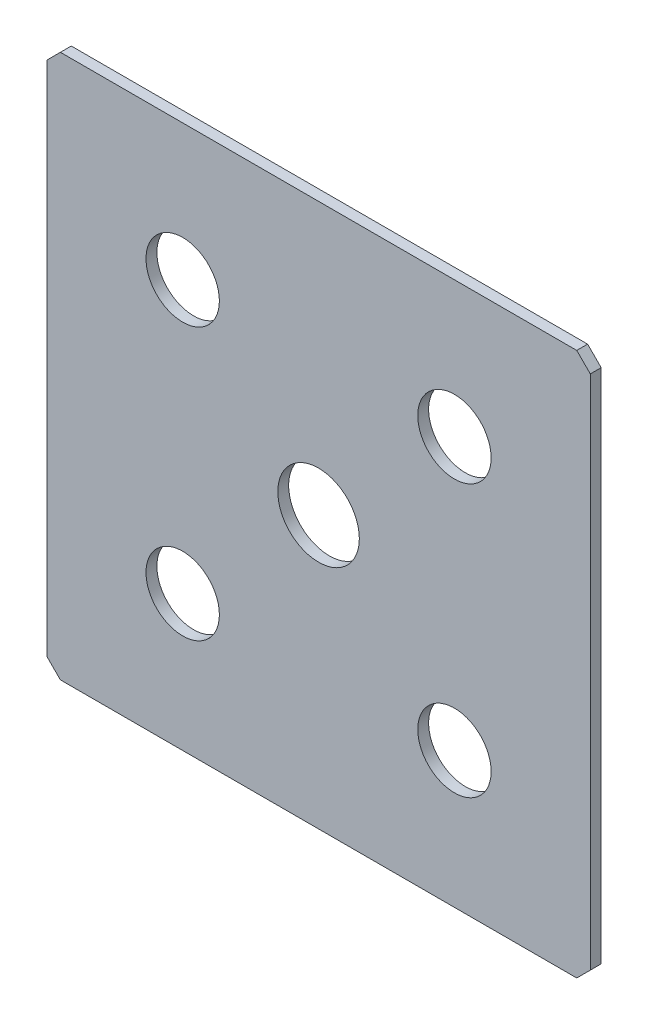
ISO-10303-21;
HEADER;
FILE_DESCRIPTION(('STEP AP214'),'2;1');
FILE_NAME('part.step','',(''),(''),'','','');
FILE_SCHEMA(('AUTOMOTIVE_DESIGN { 1 0 10303 214 1 1 1 1 }'));
ENDSEC;
DATA;
#1=APPLICATION_CONTEXT('core data for automotive mechanical design processes');
#2=APPLICATION_PROTOCOL_DEFINITION('international standard','automotive_design',2000,#1);
#3=PRODUCT_CONTEXT('',#1,'mechanical');
#4=PRODUCT('Part','Part','',(#3));
#5=PRODUCT_RELATED_PRODUCT_CATEGORY('part','',(#4));
#6=PRODUCT_DEFINITION_FORMATION('','',#4);
#7=PRODUCT_DEFINITION_CONTEXT('part definition',#1,'design');
#8=PRODUCT_DEFINITION('design','',#6,#7);
#9=PRODUCT_DEFINITION_SHAPE('','',#8);
#10=(LENGTH_UNIT() NAMED_UNIT(*) SI_UNIT(.MILLI.,.METRE.));
#11=(NAMED_UNIT(*) PLANE_ANGLE_UNIT() SI_UNIT($,.RADIAN.));
#12=(NAMED_UNIT(*) SI_UNIT($,.STERADIAN.) SOLID_ANGLE_UNIT());
#13=UNCERTAINTY_MEASURE_WITH_UNIT(LENGTH_MEASURE(1.E-05),#10,'distance_accuracy_value','');
#14=(GEOMETRIC_REPRESENTATION_CONTEXT(3) GLOBAL_UNCERTAINTY_ASSIGNED_CONTEXT((#13)) GLOBAL_UNIT_ASSIGNED_CONTEXT((#10,
#11,#12)) REPRESENTATION_CONTEXT('',''));
#15=CARTESIAN_POINT('',(0.,0.,0.));
#16=DIRECTION('',(0.,0.,1.));
#17=DIRECTION('',(1.,0.,0.));
#18=AXIS2_PLACEMENT_3D('',#15,#16,#17);
#19=CARTESIAN_POINT('',(-50.,-50.,-2.));
#20=DIRECTION('',(-1.,0.,0.));
#21=DIRECTION('',(0.,0.,1.));
#22=AXIS2_PLACEMENT_3D('',#19,#20,#21);
#23=PLANE('',#22);
#24=DIRECTION('',(0.,-1.,0.));
#25=VECTOR('',#24,1.);
#26=CARTESIAN_POINT('',(-50.,-50.,-2.));
#27=LINE('',#26,#25);
#28=CARTESIAN_POINT('',(-50.,47.5,-2.));
#29=VERTEX_POINT('',#28);
#30=CARTESIAN_POINT('',(-50.,-47.5,-2.));
#31=VERTEX_POINT('',#30);
#32=EDGE_CURVE('E159',#29,#31,#27,.T.);
#33=ORIENTED_EDGE('',*,*,#32,.T.);
#34=DIRECTION('',(0.,0.,1.));
#35=VECTOR('',#34,1.);
#36=CARTESIAN_POINT('',(-50.,-47.5,-2.));
#37=LINE('',#36,#35);
#38=CARTESIAN_POINT('',(-50.,-47.5,0.));
#39=VERTEX_POINT('',#38);
#40=EDGE_CURVE('E11',#31,#39,#37,.T.);
#41=ORIENTED_EDGE('',*,*,#40,.T.);
#42=DIRECTION('',(0.,-1.,0.));
#43=VECTOR('',#42,1.);
#44=CARTESIAN_POINT('',(-50.,-50.,0.));
#45=LINE('',#44,#43);
#46=CARTESIAN_POINT('',(-50.,47.5,0.));
#47=VERTEX_POINT('',#46);
#48=EDGE_CURVE('E162',#47,#39,#45,.T.);
#49=ORIENTED_EDGE('',*,*,#48,.F.);
#50=DIRECTION('',(0.,0.,-1.));
#51=VECTOR('',#50,1.);
#52=CARTESIAN_POINT('',(-50.,47.5,-2.));
#53=LINE('',#52,#51);
#54=EDGE_CURVE('E47',#47,#29,#53,.T.);
#55=ORIENTED_EDGE('',*,*,#54,.T.);
#56=EDGE_LOOP('',(#33,#41,#49,#55));
#57=FACE_BOUND('',#56,.T.);
#58=ADVANCED_FACE('F39',(#57),#23,.T.);
#59=CARTESIAN_POINT('',(50.,50.,-2.));
#60=DIRECTION('',(0.,1.,0.));
#61=DIRECTION('',(-1.,0.,0.));
#62=AXIS2_PLACEMENT_3D('',#59,#60,#61);
#63=PLANE('',#62);
#64=DIRECTION('',(-1.,0.,0.));
#65=VECTOR('',#64,1.);
#66=CARTESIAN_POINT('',(50.,50.,0.));
#67=LINE('',#66,#65);
#68=CARTESIAN_POINT('',(47.5,50.,0.));
#69=VERTEX_POINT('',#68);
#70=CARTESIAN_POINT('',(-47.5,50.,0.));
#71=VERTEX_POINT('',#70);
#72=EDGE_CURVE('E125',#69,#71,#67,.T.);
#73=ORIENTED_EDGE('',*,*,#72,.F.);
#74=DIRECTION('',(0.,0.,-1.));
#75=VECTOR('',#74,1.);
#76=CARTESIAN_POINT('',(47.5,50.,-2.));
#77=LINE('',#76,#75);
#78=CARTESIAN_POINT('',(47.5,50.,-2.));
#79=VERTEX_POINT('',#78);
#80=EDGE_CURVE('E143',#69,#79,#77,.T.);
#81=ORIENTED_EDGE('',*,*,#80,.T.);
#82=DIRECTION('',(-1.,0.,0.));
#83=VECTOR('',#82,1.);
#84=CARTESIAN_POINT('',(50.,50.,-2.));
#85=LINE('',#84,#83);
#86=CARTESIAN_POINT('',(-47.5,50.,-2.));
#87=VERTEX_POINT('',#86);
#88=EDGE_CURVE('E128',#79,#87,#85,.T.);
#89=ORIENTED_EDGE('',*,*,#88,.T.);
#90=DIRECTION('',(0.,0.,1.));
#91=VECTOR('',#90,1.);
#92=CARTESIAN_POINT('',(-47.5,50.,-2.));
#93=LINE('',#92,#91);
#94=EDGE_CURVE('E140',#87,#71,#93,.T.);
#95=ORIENTED_EDGE('',*,*,#94,.T.);
#96=EDGE_LOOP('',(#73,#81,#89,#95));
#97=FACE_BOUND('',#96,.T.);
#98=ADVANCED_FACE('F174',(#97),#63,.T.);
#99=CARTESIAN_POINT('',(50.,-50.,-2.));
#100=DIRECTION('',(1.,0.,0.));
#101=DIRECTION('',(0.,0.,-1.));
#102=AXIS2_PLACEMENT_3D('',#99,#100,#101);
#103=PLANE('',#102);
#104=DIRECTION('',(0.,1.,0.));
#105=VECTOR('',#104,1.);
#106=CARTESIAN_POINT('',(50.,-50.,-2.));
#107=LINE('',#106,#105);
#108=CARTESIAN_POINT('',(50.,-47.5,-2.));
#109=VERTEX_POINT('',#108);
#110=CARTESIAN_POINT('',(50.,47.5,-2.));
#111=VERTEX_POINT('',#110);
#112=EDGE_CURVE('E133',#109,#111,#107,.T.);
#113=ORIENTED_EDGE('',*,*,#112,.T.);
#114=DIRECTION('',(0.,0.,1.));
#115=VECTOR('',#114,1.);
#116=CARTESIAN_POINT('',(50.,47.5,-2.));
#117=LINE('',#116,#115);
#118=CARTESIAN_POINT('',(50.,47.5,0.));
#119=VERTEX_POINT('',#118);
#120=EDGE_CURVE('E124',#111,#119,#117,.T.);
#121=ORIENTED_EDGE('',*,*,#120,.T.);
#122=DIRECTION('',(0.,1.,0.));
#123=VECTOR('',#122,1.);
#124=CARTESIAN_POINT('',(50.,-50.,0.));
#125=LINE('',#124,#123);
#126=CARTESIAN_POINT('',(50.,-47.5,0.));
#127=VERTEX_POINT('',#126);
#128=EDGE_CURVE('E109',#127,#119,#125,.T.);
#129=ORIENTED_EDGE('',*,*,#128,.F.);
#130=DIRECTION('',(0.,0.,-1.));
#131=VECTOR('',#130,1.);
#132=CARTESIAN_POINT('',(50.,-47.5,-2.));
#133=LINE('',#132,#131);
#134=EDGE_CURVE('E122',#127,#109,#133,.T.);
#135=ORIENTED_EDGE('',*,*,#134,.T.);
#136=EDGE_LOOP('',(#113,#121,#129,#135));
#137=FACE_BOUND('',#136,.T.);
#138=ADVANCED_FACE('F121',(#137),#103,.T.);
#139=CARTESIAN_POINT('',(50.,-50.,-2.));
#140=DIRECTION('',(0.,-1.,0.));
#141=DIRECTION('',(1.,0.,0.));
#142=AXIS2_PLACEMENT_3D('',#139,#140,#141);
#143=PLANE('',#142);
#144=DIRECTION('',(1.,0.,0.));
#145=VECTOR('',#144,1.);
#146=CARTESIAN_POINT('',(50.,-50.,-2.));
#147=LINE('',#146,#145);
#148=CARTESIAN_POINT('',(-47.5,-50.,-2.));
#149=VERTEX_POINT('',#148);
#150=CARTESIAN_POINT('',(47.5,-50.,-2.));
#151=VERTEX_POINT('',#150);
#152=EDGE_CURVE('E168',#149,#151,#147,.T.);
#153=ORIENTED_EDGE('',*,*,#152,.T.);
#154=DIRECTION('',(0.,0.,1.));
#155=VECTOR('',#154,1.);
#156=CARTESIAN_POINT('',(47.5,-50.,-2.));
#157=LINE('',#156,#155);
#158=CARTESIAN_POINT('',(47.5,-50.,0.));
#159=VERTEX_POINT('',#158);
#160=EDGE_CURVE('E153',#151,#159,#157,.T.);
#161=ORIENTED_EDGE('',*,*,#160,.T.);
#162=DIRECTION('',(1.,0.,0.));
#163=VECTOR('',#162,1.);
#164=CARTESIAN_POINT('',(50.,-50.,0.));
#165=LINE('',#164,#163);
#166=CARTESIAN_POINT('',(-47.5,-50.,0.));
#167=VERTEX_POINT('',#166);
#168=EDGE_CURVE('E110',#167,#159,#165,.T.);
#169=ORIENTED_EDGE('',*,*,#168,.F.);
#170=DIRECTION('',(0.,0.,-1.));
#171=VECTOR('',#170,1.);
#172=CARTESIAN_POINT('',(-47.5,-50.,-2.));
#173=LINE('',#172,#171);
#174=EDGE_CURVE('E61',#167,#149,#173,.T.);
#175=ORIENTED_EDGE('',*,*,#174,.T.);
#176=EDGE_LOOP('',(#153,#161,#169,#175));
#177=FACE_BOUND('',#176,.T.);
#178=ADVANCED_FACE('F251',(#177),#143,.T.);
#179=CARTESIAN_POINT('',(0.,0.,-2.));
#180=DIRECTION('',(0.,0.,1.));
#181=DIRECTION('',(1.,0.,0.));
#182=AXIS2_PLACEMENT_3D('',#179,#180,#181);
#183=PLANE('',#182);
#184=CARTESIAN_POINT('',(0.,0.,-2.));
#185=DIRECTION('',(0.,0.,1.));
#186=DIRECTION('',(1.,0.,0.));
#187=AXIS2_PLACEMENT_3D('',#184,#185,#186);
#188=CIRCLE('',#187,7.5);
#189=CARTESIAN_POINT('',(7.5,0.,-2.));
#190=VERTEX_POINT('',#189);
#191=EDGE_CURVE('E210',#190,#190,#188,.T.);
#192=ORIENTED_EDGE('',*,*,#191,.T.);
#193=EDGE_LOOP('',(#192));
#194=FACE_BOUND('',#193,.T.);
#195=CARTESIAN_POINT('',(25.,25.,-2.));
#196=DIRECTION('',(0.,0.,1.));
#197=DIRECTION('',(1.,0.,0.));
#198=AXIS2_PLACEMENT_3D('',#195,#196,#197);
#199=CIRCLE('',#198,6.75);
#200=CARTESIAN_POINT('',(31.75,25.,-2.));
#201=VERTEX_POINT('',#200);
#202=EDGE_CURVE('E204',#201,#201,#199,.T.);
#203=ORIENTED_EDGE('',*,*,#202,.T.);
#204=EDGE_LOOP('',(#203));
#205=FACE_BOUND('',#204,.T.);
#206=CARTESIAN_POINT('',(-25.,-25.,-2.));
#207=DIRECTION('',(0.,0.,1.));
#208=DIRECTION('',(1.,0.,0.));
#209=AXIS2_PLACEMENT_3D('',#206,#207,#208);
#210=CIRCLE('',#209,6.75);
#211=CARTESIAN_POINT('',(-18.25,-25.,-2.));
#212=VERTEX_POINT('',#211);
#213=EDGE_CURVE('E198',#212,#212,#210,.T.);
#214=ORIENTED_EDGE('',*,*,#213,.T.);
#215=EDGE_LOOP('',(#214));
#216=FACE_BOUND('',#215,.T.);
#217=CARTESIAN_POINT('',(-25.,25.,-2.));
#218=DIRECTION('',(0.,0.,1.));
#219=DIRECTION('',(1.,0.,0.));
#220=AXIS2_PLACEMENT_3D('',#217,#218,#219);
#221=CIRCLE('',#220,6.75);
#222=CARTESIAN_POINT('',(-18.25,25.,-2.));
#223=VERTEX_POINT('',#222);
#224=EDGE_CURVE('E190',#223,#223,#221,.T.);
#225=ORIENTED_EDGE('',*,*,#224,.T.);
#226=EDGE_LOOP('',(#225));
#227=FACE_BOUND('',#226,.T.);
#228=CARTESIAN_POINT('',(25.,-25.,-2.));
#229=DIRECTION('',(0.,0.,1.));
#230=DIRECTION('',(1.,0.,0.));
#231=AXIS2_PLACEMENT_3D('',#228,#229,#230);
#232=CIRCLE('',#231,6.75);
#233=CARTESIAN_POINT('',(31.75,-25.,-2.));
#234=VERTEX_POINT('',#233);
#235=EDGE_CURVE('E183',#234,#234,#232,.T.);
#236=ORIENTED_EDGE('',*,*,#235,.T.);
#237=EDGE_LOOP('',(#236));
#238=FACE_BOUND('',#237,.T.);
#239=ORIENTED_EDGE('',*,*,#88,.F.);
#240=DIRECTION('',(-0.707106781186549,0.707106781186546,0.));
#241=VECTOR('',#240,1.);
#242=CARTESIAN_POINT('',(50.,47.5,-2.));
#243=LINE('',#242,#241);
#244=EDGE_CURVE('E150',#79,#111,#243,.F.);
#245=ORIENTED_EDGE('',*,*,#244,.T.);
#246=ORIENTED_EDGE('',*,*,#112,.F.);
#247=DIRECTION('',(0.707106781186546,0.70710678118655,0.));
#248=VECTOR('',#247,1.);
#249=CARTESIAN_POINT('',(47.5,-50.,-2.));
#250=LINE('',#249,#248);
#251=EDGE_CURVE('E54',#109,#151,#250,.F.);
#252=ORIENTED_EDGE('',*,*,#251,.T.);
#253=ORIENTED_EDGE('',*,*,#152,.F.);
#254=DIRECTION('',(0.707106781186549,-0.707106781186546,0.));
#255=VECTOR('',#254,1.);
#256=CARTESIAN_POINT('',(-50.,-47.5,-2.));
#257=LINE('',#256,#255);
#258=EDGE_CURVE('E147',#149,#31,#257,.F.);
#259=ORIENTED_EDGE('',*,*,#258,.T.);
#260=ORIENTED_EDGE('',*,*,#32,.F.);
#261=DIRECTION('',(-0.707106781186545,-0.70710678118655,0.));
#262=VECTOR('',#261,1.);
#263=CARTESIAN_POINT('',(-47.5,50.,-2.));
#264=LINE('',#263,#262);
#265=EDGE_CURVE('E145',#29,#87,#264,.F.);
#266=ORIENTED_EDGE('',*,*,#265,.T.);
#267=EDGE_LOOP('',(#239,#245,#246,#252,#253,#259,#260,#266));
#268=FACE_BOUND('',#267,.T.);
#269=ADVANCED_FACE('F166',(#194,#205,#216,#227,#238,#268),#183,.F.);
#270=CARTESIAN_POINT('',(0.,0.,0.));
#271=DIRECTION('',(0.,0.,1.));
#272=DIRECTION('',(1.,0.,0.));
#273=AXIS2_PLACEMENT_3D('',#270,#271,#272);
#274=PLANE('',#273);
#275=CARTESIAN_POINT('',(0.,0.,0.));
#276=DIRECTION('',(0.,0.,1.));
#277=DIRECTION('',(1.,0.,0.));
#278=AXIS2_PLACEMENT_3D('',#275,#276,#277);
#279=CIRCLE('',#278,7.5);
#280=CARTESIAN_POINT('',(7.5,0.,0.));
#281=VERTEX_POINT('',#280);
#282=EDGE_CURVE('E213',#281,#281,#279,.T.);
#283=ORIENTED_EDGE('',*,*,#282,.F.);
#284=EDGE_LOOP('',(#283));
#285=FACE_BOUND('',#284,.T.);
#286=CARTESIAN_POINT('',(25.,25.,0.));
#287=DIRECTION('',(0.,0.,1.));
#288=DIRECTION('',(1.,0.,0.));
#289=AXIS2_PLACEMENT_3D('',#286,#287,#288);
#290=CIRCLE('',#289,6.75);
#291=CARTESIAN_POINT('',(31.75,25.,0.));
#292=VERTEX_POINT('',#291);
#293=EDGE_CURVE('E207',#292,#292,#290,.T.);
#294=ORIENTED_EDGE('',*,*,#293,.F.);
#295=EDGE_LOOP('',(#294));
#296=FACE_BOUND('',#295,.T.);
#297=CARTESIAN_POINT('',(-25.,-25.,0.));
#298=DIRECTION('',(0.,0.,1.));
#299=DIRECTION('',(1.,0.,0.));
#300=AXIS2_PLACEMENT_3D('',#297,#298,#299);
#301=CIRCLE('',#300,6.75);
#302=CARTESIAN_POINT('',(-18.25,-25.,0.));
#303=VERTEX_POINT('',#302);
#304=EDGE_CURVE('E201',#303,#303,#301,.T.);
#305=ORIENTED_EDGE('',*,*,#304,.F.);
#306=EDGE_LOOP('',(#305));
#307=FACE_BOUND('',#306,.T.);
#308=CARTESIAN_POINT('',(-25.,25.,0.));
#309=DIRECTION('',(0.,0.,1.));
#310=DIRECTION('',(1.,0.,0.));
#311=AXIS2_PLACEMENT_3D('',#308,#309,#310);
#312=CIRCLE('',#311,6.75);
#313=CARTESIAN_POINT('',(-18.25,25.,0.));
#314=VERTEX_POINT('',#313);
#315=EDGE_CURVE('E195',#314,#314,#312,.T.);
#316=ORIENTED_EDGE('',*,*,#315,.F.);
#317=EDGE_LOOP('',(#316));
#318=FACE_BOUND('',#317,.T.);
#319=CARTESIAN_POINT('',(25.,-25.,0.));
#320=DIRECTION('',(0.,0.,1.));
#321=DIRECTION('',(1.,0.,0.));
#322=AXIS2_PLACEMENT_3D('',#319,#320,#321);
#323=CIRCLE('',#322,6.75);
#324=CARTESIAN_POINT('',(31.75,-25.,0.));
#325=VERTEX_POINT('',#324);
#326=EDGE_CURVE('E185',#325,#325,#323,.T.);
#327=ORIENTED_EDGE('',*,*,#326,.F.);
#328=EDGE_LOOP('',(#327));
#329=FACE_BOUND('',#328,.T.);
#330=ORIENTED_EDGE('',*,*,#128,.T.);
#331=DIRECTION('',(0.707106781186549,-0.707106781186546,0.));
#332=VECTOR('',#331,1.);
#333=CARTESIAN_POINT('',(48.7499999999999,48.7500000000001,0.));
#334=LINE('',#333,#332);
#335=EDGE_CURVE('E115',#119,#69,#334,.F.);
#336=ORIENTED_EDGE('',*,*,#335,.T.);
#337=ORIENTED_EDGE('',*,*,#72,.T.);
#338=DIRECTION('',(0.707106781186545,0.70710678118655,0.));
#339=VECTOR('',#338,1.);
#340=CARTESIAN_POINT('',(-48.7500000000002,48.7499999999998,0.));
#341=LINE('',#340,#339);
#342=EDGE_CURVE('E130',#71,#47,#341,.F.);
#343=ORIENTED_EDGE('',*,*,#342,.T.);
#344=ORIENTED_EDGE('',*,*,#48,.T.);
#345=DIRECTION('',(-0.707106781186549,0.707106781186546,0.));
#346=VECTOR('',#345,1.);
#347=CARTESIAN_POINT('',(-48.7499999999999,-48.7500000000001,0.));
#348=LINE('',#347,#346);
#349=EDGE_CURVE('E116',#39,#167,#348,.F.);
#350=ORIENTED_EDGE('',*,*,#349,.T.);
#351=ORIENTED_EDGE('',*,*,#168,.T.);
#352=DIRECTION('',(-0.707106781186546,-0.70710678118655,0.));
#353=VECTOR('',#352,1.);
#354=CARTESIAN_POINT('',(48.7500000000001,-48.7499999999999,0.));
#355=LINE('',#354,#353);
#356=EDGE_CURVE('E106',#159,#127,#355,.F.);
#357=ORIENTED_EDGE('',*,*,#356,.T.);
#358=EDGE_LOOP('',(#330,#336,#337,#343,#344,#350,#351,#357));
#359=FACE_BOUND('',#358,.T.);
#360=ADVANCED_FACE('F108',(#285,#296,#307,#318,#329,#359),#274,.T.);
#361=CARTESIAN_POINT('',(25.,-25.,0.));
#362=DIRECTION('',(0.,0.,1.));
#363=DIRECTION('',(1.,0.,0.));
#364=AXIS2_PLACEMENT_3D('',#361,#362,#363);
#365=CYLINDRICAL_SURFACE('',#364,6.75);
#366=ORIENTED_EDGE('',*,*,#326,.T.);
#367=EDGE_LOOP('',(#366));
#368=FACE_BOUND('',#367,.T.);
#369=ORIENTED_EDGE('',*,*,#235,.F.);
#370=EDGE_LOOP('',(#369));
#371=FACE_BOUND('',#370,.T.);
#372=ADVANCED_FACE('F222',(#368,#371),#365,.F.);
#373=CARTESIAN_POINT('',(-25.,25.,0.));
#374=DIRECTION('',(0.,0.,1.));
#375=DIRECTION('',(1.,0.,0.));
#376=AXIS2_PLACEMENT_3D('',#373,#374,#375);
#377=CYLINDRICAL_SURFACE('',#376,6.75);
#378=ORIENTED_EDGE('',*,*,#315,.T.);
#379=EDGE_LOOP('',(#378));
#380=FACE_BOUND('',#379,.T.);
#381=ORIENTED_EDGE('',*,*,#224,.F.);
#382=EDGE_LOOP('',(#381));
#383=FACE_BOUND('',#382,.T.);
#384=ADVANCED_FACE('F234',(#380,#383),#377,.F.);
#385=CARTESIAN_POINT('',(-25.,-25.,0.));
#386=DIRECTION('',(0.,0.,1.));
#387=DIRECTION('',(1.,0.,0.));
#388=AXIS2_PLACEMENT_3D('',#385,#386,#387);
#389=CYLINDRICAL_SURFACE('',#388,6.75);
#390=ORIENTED_EDGE('',*,*,#304,.T.);
#391=EDGE_LOOP('',(#390));
#392=FACE_BOUND('',#391,.T.);
#393=ORIENTED_EDGE('',*,*,#213,.F.);
#394=EDGE_LOOP('',(#393));
#395=FACE_BOUND('',#394,.T.);
#396=ADVANCED_FACE('F239',(#392,#395),#389,.F.);
#397=CARTESIAN_POINT('',(25.,25.,0.));
#398=DIRECTION('',(0.,0.,1.));
#399=DIRECTION('',(1.,0.,0.));
#400=AXIS2_PLACEMENT_3D('',#397,#398,#399);
#401=CYLINDRICAL_SURFACE('',#400,6.75);
#402=ORIENTED_EDGE('',*,*,#293,.T.);
#403=EDGE_LOOP('',(#402));
#404=FACE_BOUND('',#403,.T.);
#405=ORIENTED_EDGE('',*,*,#202,.F.);
#406=EDGE_LOOP('',(#405));
#407=FACE_BOUND('',#406,.T.);
#408=ADVANCED_FACE('F289',(#404,#407),#401,.F.);
#409=CARTESIAN_POINT('',(0.,0.,-10.));
#410=DIRECTION('',(0.,0.,1.));
#411=DIRECTION('',(1.,0.,0.));
#412=AXIS2_PLACEMENT_3D('',#409,#410,#411);
#413=CYLINDRICAL_SURFACE('',#412,7.5);
#414=ORIENTED_EDGE('',*,*,#282,.T.);
#415=EDGE_LOOP('',(#414));
#416=FACE_BOUND('',#415,.T.);
#417=ORIENTED_EDGE('',*,*,#191,.F.);
#418=EDGE_LOOP('',(#417));
#419=FACE_BOUND('',#418,.T.);
#420=ADVANCED_FACE('F217',(#416,#419),#413,.F.);
#421=CARTESIAN_POINT('',(50.,47.5,-2.));
#422=DIRECTION('',(-0.707106781186546,-0.707106781186549,0.));
#423=DIRECTION('',(0.,0.,1.));
#424=AXIS2_PLACEMENT_3D('',#421,#422,#423);
#425=PLANE('',#424);
#426=ORIENTED_EDGE('',*,*,#244,.F.);
#427=ORIENTED_EDGE('',*,*,#80,.F.);
#428=ORIENTED_EDGE('',*,*,#335,.F.);
#429=ORIENTED_EDGE('',*,*,#120,.F.);
#430=EDGE_LOOP('',(#426,#427,#428,#429));
#431=FACE_BOUND('',#430,.T.);
#432=ADVANCED_FACE('F178',(#431),#425,.F.);
#433=CARTESIAN_POINT('',(47.5,-50.,-2.));
#434=DIRECTION('',(-0.707106781186549,0.707106781186545,0.));
#435=DIRECTION('',(0.,0.,1.));
#436=AXIS2_PLACEMENT_3D('',#433,#434,#435);
#437=PLANE('',#436);
#438=ORIENTED_EDGE('',*,*,#251,.F.);
#439=ORIENTED_EDGE('',*,*,#134,.F.);
#440=ORIENTED_EDGE('',*,*,#356,.F.);
#441=ORIENTED_EDGE('',*,*,#160,.F.);
#442=EDGE_LOOP('',(#438,#439,#440,#441));
#443=FACE_BOUND('',#442,.T.);
#444=ADVANCED_FACE('F127',(#443),#437,.F.);
#445=CARTESIAN_POINT('',(-50.,-47.5,-2.));
#446=DIRECTION('',(0.707106781186546,0.707106781186549,0.));
#447=DIRECTION('',(0.,0.,1.));
#448=AXIS2_PLACEMENT_3D('',#445,#446,#447);
#449=PLANE('',#448);
#450=ORIENTED_EDGE('',*,*,#258,.F.);
#451=ORIENTED_EDGE('',*,*,#174,.F.);
#452=ORIENTED_EDGE('',*,*,#349,.F.);
#453=ORIENTED_EDGE('',*,*,#40,.F.);
#454=EDGE_LOOP('',(#450,#451,#452,#453));
#455=FACE_BOUND('',#454,.T.);
#456=ADVANCED_FACE('F256',(#455),#449,.F.);
#457=CARTESIAN_POINT('',(-47.5,50.,-2.));
#458=DIRECTION('',(0.70710678118655,-0.707106781186544,0.));
#459=DIRECTION('',(0.,0.,1.));
#460=AXIS2_PLACEMENT_3D('',#457,#458,#459);
#461=PLANE('',#460);
#462=ORIENTED_EDGE('',*,*,#265,.F.);
#463=ORIENTED_EDGE('',*,*,#54,.F.);
#464=ORIENTED_EDGE('',*,*,#342,.F.);
#465=ORIENTED_EDGE('',*,*,#94,.F.);
#466=EDGE_LOOP('',(#462,#463,#464,#465));
#467=FACE_BOUND('',#466,.T.);
#468=ADVANCED_FACE('F41',(#467),#461,.F.);
#469=CLOSED_SHELL('',(#58,#98,#138,#178,#269,#360,#372,#384,#396,#408,#420,#432,#444,#456,#468));
#470=MANIFOLD_SOLID_BREP('B2',#469);
#471=ADVANCED_BREP_SHAPE_REPRESENTATION('',(#18,#470),#14);
#472=SHAPE_DEFINITION_REPRESENTATION(#9,#471);
ENDSEC;
END-ISO-10303-21;
